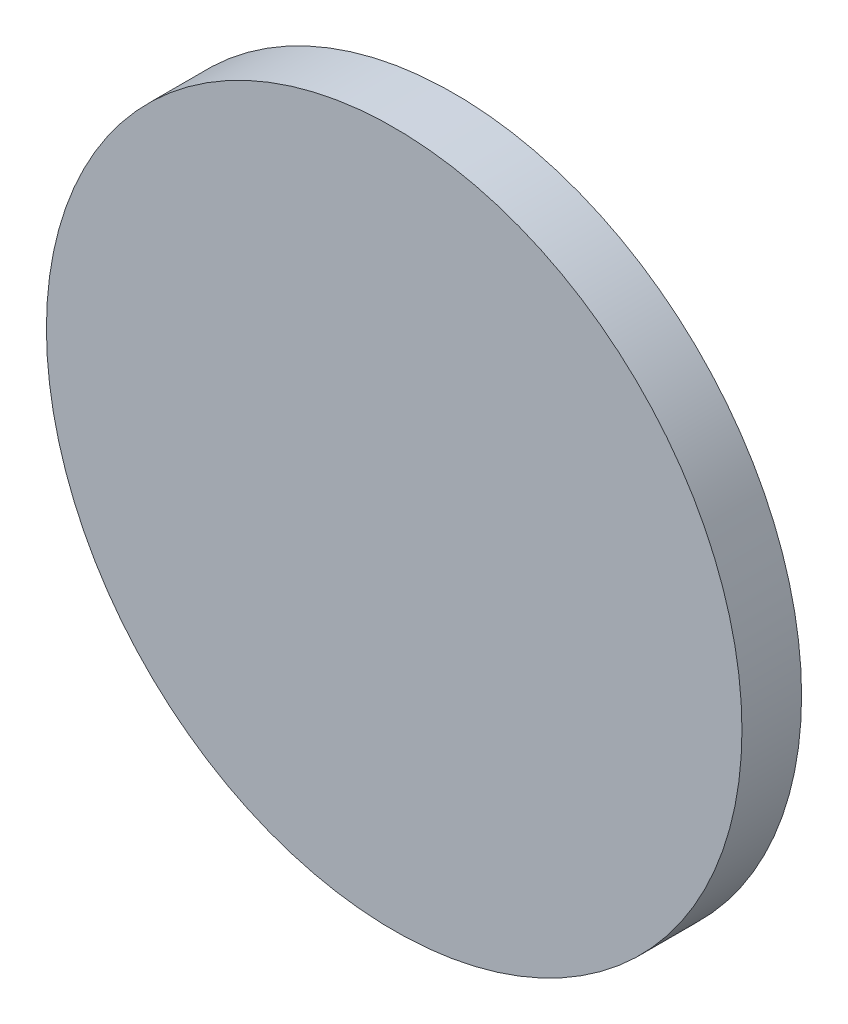
ISO-10303-21;
HEADER;
FILE_DESCRIPTION(('STEP AP214'),'2;1');
FILE_NAME('part.step','',(''),(''),'','','');
FILE_SCHEMA(('AUTOMOTIVE_DESIGN { 1 0 10303 214 1 1 1 1 }'));
ENDSEC;
DATA;
#1=APPLICATION_CONTEXT('core data for automotive mechanical design processes');
#2=APPLICATION_PROTOCOL_DEFINITION('international standard','automotive_design',2000,#1);
#3=PRODUCT_CONTEXT('',#1,'mechanical');
#4=PRODUCT('Part','Part','',(#3));
#5=PRODUCT_RELATED_PRODUCT_CATEGORY('part','',(#4));
#6=PRODUCT_DEFINITION_FORMATION('','',#4);
#7=PRODUCT_DEFINITION_CONTEXT('part definition',#1,'design');
#8=PRODUCT_DEFINITION('design','',#6,#7);
#9=PRODUCT_DEFINITION_SHAPE('','',#8);
#10=(LENGTH_UNIT() NAMED_UNIT(*) SI_UNIT(.MILLI.,.METRE.));
#11=(NAMED_UNIT(*) PLANE_ANGLE_UNIT() SI_UNIT($,.RADIAN.));
#12=(NAMED_UNIT(*) SI_UNIT($,.STERADIAN.) SOLID_ANGLE_UNIT());
#13=UNCERTAINTY_MEASURE_WITH_UNIT(LENGTH_MEASURE(1.E-05),#10,'distance_accuracy_value','');
#14=(GEOMETRIC_REPRESENTATION_CONTEXT(3) GLOBAL_UNCERTAINTY_ASSIGNED_CONTEXT((#13)) GLOBAL_UNIT_ASSIGNED_CONTEXT((#10,
#11,#12)) REPRESENTATION_CONTEXT('',''));
#15=CARTESIAN_POINT('',(0.,0.,0.));
#16=DIRECTION('',(0.,0.,1.));
#17=DIRECTION('',(1.,0.,0.));
#18=AXIS2_PLACEMENT_3D('',#15,#16,#17);
#19=CARTESIAN_POINT('',(0.64916,11.194908667,0.79916));
#20=DIRECTION('',(0.,0.,1.));
#21=DIRECTION('',(1.,0.,0.));
#22=AXIS2_PLACEMENT_3D('',#19,#20,#21);
#23=PLANE('',#22);
#24=CARTESIAN_POINT('',(0.64916,11.194908667,0.79916));
#25=DIRECTION('',(0.,0.,1.));
#26=DIRECTION('',(1.,0.,0.));
#27=AXIS2_PLACEMENT_3D('',#24,#25,#26);
#28=CIRCLE('',#27,0.2);
#29=CARTESIAN_POINT('',(0.84916,11.194908667,0.79916));
#30=VERTEX_POINT('',#29);
#31=EDGE_CURVE('E18',#30,#30,#28,.F.);
#32=ORIENTED_EDGE('',*,*,#31,.F.);
#33=EDGE_LOOP('',(#32));
#34=FACE_BOUND('',#33,.T.);
#35=ADVANCED_FACE('F15',(#34),#23,.T.);
#36=CARTESIAN_POINT('',(0.64916,11.194908667,0.76487));
#37=DIRECTION('',(0.,0.,1.));
#38=DIRECTION('',(1.,0.,0.));
#39=AXIS2_PLACEMENT_3D('',#36,#37,#38);
#40=CYLINDRICAL_SURFACE('',#39,0.2);
#41=ORIENTED_EDGE('',*,*,#31,.T.);
#42=EDGE_LOOP('',(#41));
#43=FACE_BOUND('',#42,.T.);
#44=CARTESIAN_POINT('',(0.64916,11.194908667,0.76487));
#45=DIRECTION('',(0.,0.,1.));
#46=DIRECTION('',(1.,0.,0.));
#47=AXIS2_PLACEMENT_3D('',#44,#45,#46);
#48=CIRCLE('',#47,0.2);
#49=CARTESIAN_POINT('',(0.84916,11.194908667,0.76487));
#50=VERTEX_POINT('',#49);
#51=EDGE_CURVE('E10',#50,#50,#48,.F.);
#52=ORIENTED_EDGE('',*,*,#51,.F.);
#53=EDGE_LOOP('',(#52));
#54=FACE_BOUND('',#53,.T.);
#55=ADVANCED_FACE('F27',(#43,#54),#40,.T.);
#56=CARTESIAN_POINT('',(0.64916,11.194908667,0.76487));
#57=DIRECTION('',(0.,0.,-1.));
#58=DIRECTION('',(-1.,0.,0.));
#59=AXIS2_PLACEMENT_3D('',#56,#57,#58);
#60=PLANE('',#59);
#61=ORIENTED_EDGE('',*,*,#51,.T.);
#62=EDGE_LOOP('',(#61));
#63=FACE_BOUND('',#62,.T.);
#64=ADVANCED_FACE('F35',(#63),#60,.T.);
#65=CLOSED_SHELL('',(#35,#55,#64));
#66=MANIFOLD_SOLID_BREP('B1',#65);
#67=ADVANCED_BREP_SHAPE_REPRESENTATION('',(#18,#66),#14);
#68=SHAPE_DEFINITION_REPRESENTATION(#9,#67);
ENDSEC;
END-ISO-10303-21;
